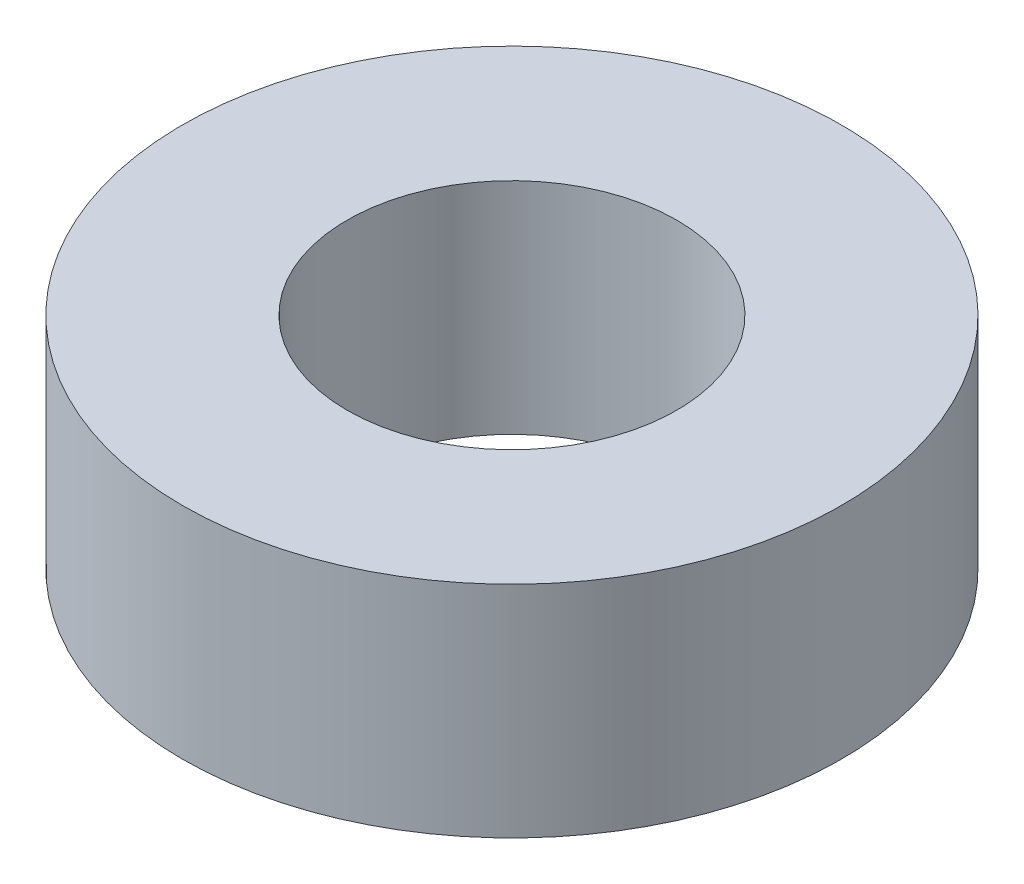
ISO-10303-21;
HEADER;
FILE_DESCRIPTION(('STEP AP214'),'2;1');
FILE_NAME('part.step','',(''),(''),'','','');
FILE_SCHEMA(('AUTOMOTIVE_DESIGN { 1 0 10303 214 1 1 1 1 }'));
ENDSEC;
DATA;
#1=APPLICATION_CONTEXT('core data for automotive mechanical design processes');
#2=APPLICATION_PROTOCOL_DEFINITION('international standard','automotive_design',2000,#1);
#3=PRODUCT_CONTEXT('',#1,'mechanical');
#4=PRODUCT('Part','Part','',(#3));
#5=PRODUCT_RELATED_PRODUCT_CATEGORY('part','',(#4));
#6=PRODUCT_DEFINITION_FORMATION('','',#4);
#7=PRODUCT_DEFINITION_CONTEXT('part definition',#1,'design');
#8=PRODUCT_DEFINITION('design','',#6,#7);
#9=PRODUCT_DEFINITION_SHAPE('','',#8);
#10=(LENGTH_UNIT() NAMED_UNIT(*) SI_UNIT(.MILLI.,.METRE.));
#11=(NAMED_UNIT(*) PLANE_ANGLE_UNIT() SI_UNIT($,.RADIAN.));
#12=(NAMED_UNIT(*) SI_UNIT($,.STERADIAN.) SOLID_ANGLE_UNIT());
#13=UNCERTAINTY_MEASURE_WITH_UNIT(LENGTH_MEASURE(1.E-05),#10,'distance_accuracy_value','');
#14=(GEOMETRIC_REPRESENTATION_CONTEXT(3) GLOBAL_UNCERTAINTY_ASSIGNED_CONTEXT((#13)) GLOBAL_UNIT_ASSIGNED_CONTEXT((#10,
#11,#12)) REPRESENTATION_CONTEXT('',''));
#15=CARTESIAN_POINT('',(0.,0.,0.));
#16=DIRECTION('',(0.,0.,1.));
#17=DIRECTION('',(1.,0.,0.));
#18=AXIS2_PLACEMENT_3D('',#15,#16,#17);
#19=CARTESIAN_POINT('',(0.,30.,0.));
#20=DIRECTION('',(0.,-1.,0.));
#21=DIRECTION('',(0.,0.,-1.));
#22=AXIS2_PLACEMENT_3D('',#19,#20,#21);
#23=CYLINDRICAL_SURFACE('',#22,45.);
#24=CARTESIAN_POINT('',(0.,30.,0.));
#25=DIRECTION('',(0.,1.,0.));
#26=DIRECTION('',(0.,0.,1.));
#27=AXIS2_PLACEMENT_3D('',#24,#25,#26);
#28=CIRCLE('',#27,45.);
#29=CARTESIAN_POINT('',(0.,30.,45.));
#30=VERTEX_POINT('',#29);
#31=EDGE_CURVE('E10',#30,#30,#28,.T.);
#32=ORIENTED_EDGE('',*,*,#31,.F.);
#33=EDGE_LOOP('',(#32));
#34=FACE_BOUND('',#33,.T.);
#35=CARTESIAN_POINT('',(0.,0.,0.));
#36=DIRECTION('',(0.,1.,0.));
#37=DIRECTION('',(0.,0.,1.));
#38=AXIS2_PLACEMENT_3D('',#35,#36,#37);
#39=CIRCLE('',#38,45.);
#40=CARTESIAN_POINT('',(0.,0.,45.));
#41=VERTEX_POINT('',#40);
#42=EDGE_CURVE('E37',#41,#41,#39,.T.);
#43=ORIENTED_EDGE('',*,*,#42,.T.);
#44=EDGE_LOOP('',(#43));
#45=FACE_BOUND('',#44,.T.);
#46=ADVANCED_FACE('F40',(#34,#45),#23,.T.);
#47=CARTESIAN_POINT('',(0.,30.,0.));
#48=DIRECTION('',(0.,1.,0.));
#49=DIRECTION('',(0.,0.,1.));
#50=AXIS2_PLACEMENT_3D('',#47,#48,#49);
#51=PLANE('',#50);
#52=CARTESIAN_POINT('',(0.,30.,0.));
#53=DIRECTION('',(0.,1.,0.));
#54=DIRECTION('',(0.,0.,1.));
#55=AXIS2_PLACEMENT_3D('',#52,#53,#54);
#56=CIRCLE('',#55,22.5);
#57=CARTESIAN_POINT('',(0.,30.,22.5));
#58=VERTEX_POINT('',#57);
#59=EDGE_CURVE('E50',#58,#58,#56,.T.);
#60=ORIENTED_EDGE('',*,*,#59,.F.);
#61=EDGE_LOOP('',(#60));
#62=FACE_BOUND('',#61,.T.);
#63=ORIENTED_EDGE('',*,*,#31,.T.);
#64=EDGE_LOOP('',(#63));
#65=FACE_BOUND('',#64,.T.);
#66=ADVANCED_FACE('F59',(#62,#65),#51,.T.);
#67=CARTESIAN_POINT('',(0.,0.,0.));
#68=DIRECTION('',(0.,1.,0.));
#69=DIRECTION('',(0.,0.,1.));
#70=AXIS2_PLACEMENT_3D('',#67,#68,#69);
#71=PLANE('',#70);
#72=CARTESIAN_POINT('',(0.,0.,0.));
#73=DIRECTION('',(0.,1.,0.));
#74=DIRECTION('',(0.,0.,1.));
#75=AXIS2_PLACEMENT_3D('',#72,#73,#74);
#76=CIRCLE('',#75,22.5);
#77=CARTESIAN_POINT('',(0.,0.,22.5));
#78=VERTEX_POINT('',#77);
#79=EDGE_CURVE('E47',#78,#78,#76,.T.);
#80=ORIENTED_EDGE('',*,*,#79,.T.);
#81=EDGE_LOOP('',(#80));
#82=FACE_BOUND('',#81,.T.);
#83=ORIENTED_EDGE('',*,*,#42,.F.);
#84=EDGE_LOOP('',(#83));
#85=FACE_BOUND('',#84,.T.);
#86=ADVANCED_FACE('F58',(#82,#85),#71,.F.);
#87=CARTESIAN_POINT('',(0.,30.,0.));
#88=DIRECTION('',(0.,-1.,0.));
#89=DIRECTION('',(0.,0.,-1.));
#90=AXIS2_PLACEMENT_3D('',#87,#88,#89);
#91=CYLINDRICAL_SURFACE('',#90,22.5);
#92=ORIENTED_EDGE('',*,*,#59,.T.);
#93=EDGE_LOOP('',(#92));
#94=FACE_BOUND('',#93,.T.);
#95=ORIENTED_EDGE('',*,*,#79,.F.);
#96=EDGE_LOOP('',(#95));
#97=FACE_BOUND('',#96,.T.);
#98=ADVANCED_FACE('F54',(#94,#97),#91,.F.);
#99=CLOSED_SHELL('',(#46,#66,#86,#98));
#100=MANIFOLD_SOLID_BREP('B2',#99);
#101=ADVANCED_BREP_SHAPE_REPRESENTATION('',(#18,#100),#14);
#102=SHAPE_DEFINITION_REPRESENTATION(#9,#101);
ENDSEC;
END-ISO-10303-21;
